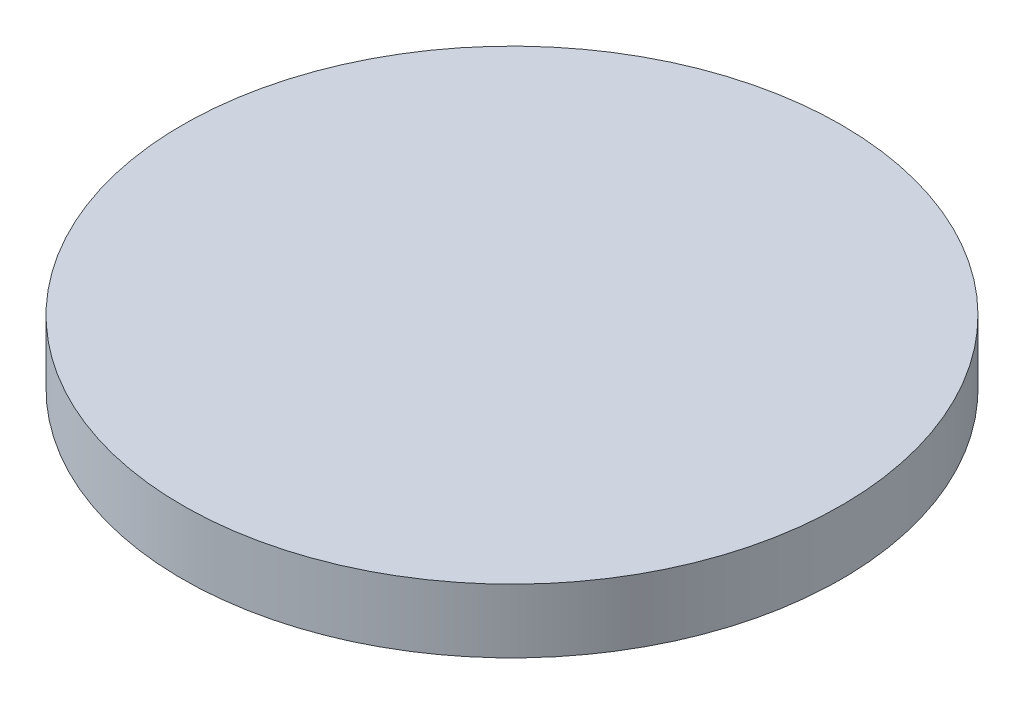
ISO-10303-21;
HEADER;
FILE_DESCRIPTION(('STEP AP214'),'2;1');
FILE_NAME('part.step','',(''),(''),'','','');
FILE_SCHEMA(('AUTOMOTIVE_DESIGN { 1 0 10303 214 1 1 1 1 }'));
ENDSEC;
DATA;
#1=APPLICATION_CONTEXT('core data for automotive mechanical design processes');
#2=APPLICATION_PROTOCOL_DEFINITION('international standard','automotive_design',2000,#1);
#3=PRODUCT_CONTEXT('',#1,'mechanical');
#4=PRODUCT('Part','Part','',(#3));
#5=PRODUCT_RELATED_PRODUCT_CATEGORY('part','',(#4));
#6=PRODUCT_DEFINITION_FORMATION('','',#4);
#7=PRODUCT_DEFINITION_CONTEXT('part definition',#1,'design');
#8=PRODUCT_DEFINITION('design','',#6,#7);
#9=PRODUCT_DEFINITION_SHAPE('','',#8);
#10=(LENGTH_UNIT() NAMED_UNIT(*) SI_UNIT(.MILLI.,.METRE.));
#11=(NAMED_UNIT(*) PLANE_ANGLE_UNIT() SI_UNIT($,.RADIAN.));
#12=(NAMED_UNIT(*) SI_UNIT($,.STERADIAN.) SOLID_ANGLE_UNIT());
#13=UNCERTAINTY_MEASURE_WITH_UNIT(LENGTH_MEASURE(1.E-05),#10,'distance_accuracy_value','');
#14=(GEOMETRIC_REPRESENTATION_CONTEXT(3) GLOBAL_UNCERTAINTY_ASSIGNED_CONTEXT((#13)) GLOBAL_UNIT_ASSIGNED_CONTEXT((#10,
#11,#12)) REPRESENTATION_CONTEXT('',''));
#15=CARTESIAN_POINT('',(0.,0.,0.));
#16=DIRECTION('',(0.,0.,1.));
#17=DIRECTION('',(1.,0.,0.));
#18=AXIS2_PLACEMENT_3D('',#15,#16,#17);
#19=CARTESIAN_POINT('',(-312.69393716758,-1885.58260369703,4006.6058874503));
#20=CARTESIAN_POINT('',(-308.655876363543,-1885.58260369703,4006.6058874503));
#21=CARTESIAN_POINT('',(-300.57975475547,-1885.58260369703,4007.00264186326));
#22=CARTESIAN_POINT('',(-288.582238542273,-1885.58260369703,4008.78230527876));
#23=CARTESIAN_POINT('',(-276.816931167634,-1885.58260369703,4011.72936135875));
#24=CARTESIAN_POINT('',(-265.39713897314,-1885.58260369703,4015.81542834216));
#25=CARTESIAN_POINT('',(-254.432840800319,-1885.58260369703,4021.00115517027));
#26=CARTESIAN_POINT('',(-244.029628834269,-1885.58260369703,4027.23660045893));
#27=CARTESIAN_POINT('',(-234.287691693199,-1885.58260369703,4034.46171346135));
#28=CARTESIAN_POINT('',(-225.30084955726,-1885.58260369703,4042.60691238968));
#29=CARTESIAN_POINT('',(-217.15565062893,-1885.58260369703,4051.59375452562));
#30=CARTESIAN_POINT('',(-209.930537626507,-1885.58260369703,4061.33569166669));
#31=CARTESIAN_POINT('',(-203.695092337853,-1885.58260369703,4071.73890363274));
#32=CARTESIAN_POINT('',(-198.509365509739,-1885.58260369703,4082.70320180556));
#33=CARTESIAN_POINT('',(-194.423298526326,-1885.58260369703,4094.12299400005));
#34=CARTESIAN_POINT('',(-191.476242446337,-1885.58260369703,4105.88830137469));
#35=CARTESIAN_POINT('',(-189.696579030845,-1885.58260369703,4117.88581758789));
#36=CARTESIAN_POINT('',(-189.101447411405,-1885.58260369703,4130.));
#37=CARTESIAN_POINT('',(-189.696579030845,-1885.58260369703,4142.11418241211));
#38=CARTESIAN_POINT('',(-191.476242446337,-1885.58260369703,4154.11169862531));
#39=CARTESIAN_POINT('',(-194.423298526326,-1885.58260369703,4165.87700599995));
#40=CARTESIAN_POINT('',(-198.509365509739,-1885.58260369703,4177.29679819444));
#41=CARTESIAN_POINT('',(-203.695092337853,-1885.58260369703,4188.26109636726));
#42=CARTESIAN_POINT('',(-209.930537626507,-1885.58260369703,4198.66430833331));
#43=CARTESIAN_POINT('',(-217.15565062893,-1885.58260369703,4208.40624547438));
#44=CARTESIAN_POINT('',(-225.30084955726,-1885.58260369703,4217.39308761032));
#45=CARTESIAN_POINT('',(-234.287691693198,-1885.58260369703,4225.53828653865));
#46=CARTESIAN_POINT('',(-244.029628834269,-1885.58260369703,4232.76339954107));
#47=CARTESIAN_POINT('',(-254.432840800319,-1885.58260369703,4238.99884482973));
#48=CARTESIAN_POINT('',(-265.39713897314,-1885.58260369703,4244.18457165784));
#49=CARTESIAN_POINT('',(-276.816931167634,-1885.58260369703,4248.27063864125));
#50=CARTESIAN_POINT('',(-288.582238542273,-1885.58260369703,4251.21769472124));
#51=CARTESIAN_POINT('',(-300.579754755469,-1885.58260369703,4252.99735813674));
#52=CARTESIAN_POINT('',(-312.69393716758,-1885.58260369703,4253.59248975617));
#53=CARTESIAN_POINT('',(-324.808119579691,-1885.58260369703,4252.99735813674));
#54=CARTESIAN_POINT('',(-336.805635792887,-1885.58260369703,4251.21769472124));
#55=CARTESIAN_POINT('',(-348.570943167527,-1885.58260369703,4248.27063864126));
#56=CARTESIAN_POINT('',(-359.990735362021,-1885.58260369703,4244.18457165784));
#57=CARTESIAN_POINT('',(-370.955033534842,-1885.58260369703,4238.99884482973));
#58=CARTESIAN_POINT('',(-381.358245500891,-1885.58260369703,4232.76339954107));
#59=CARTESIAN_POINT('',(-391.100182641962,-1885.58260369703,4225.53828653865));
#60=CARTESIAN_POINT('',(-400.087024777901,-1885.58260369703,4217.39308761032));
#61=CARTESIAN_POINT('',(-408.232223706231,-1885.58260369703,4208.40624547438));
#62=CARTESIAN_POINT('',(-415.457336708654,-1885.58260369703,4198.66430833331));
#63=CARTESIAN_POINT('',(-421.692781997308,-1885.58260369703,4188.26109636726));
#64=CARTESIAN_POINT('',(-426.878508825421,-1885.58260369703,4177.29679819444));
#65=CARTESIAN_POINT('',(-430.964575808835,-1885.58260369703,4165.87700599995));
#66=CARTESIAN_POINT('',(-433.911631888824,-1885.58260369703,4154.11169862531));
#67=CARTESIAN_POINT('',(-435.691295304316,-1885.58260369703,4142.11418241211));
#68=CARTESIAN_POINT('',(-436.286426923756,-1885.58260369703,4130.));
#69=CARTESIAN_POINT('',(-435.691295304316,-1885.58260369703,4117.88581758789));
#70=CARTESIAN_POINT('',(-433.911631888824,-1885.58260369703,4105.88830137469));
#71=CARTESIAN_POINT('',(-430.964575808835,-1885.58260369703,4094.12299400005));
#72=CARTESIAN_POINT('',(-426.878508825421,-1885.58260369703,4082.70320180556));
#73=CARTESIAN_POINT('',(-421.692781997308,-1885.58260369703,4071.73890363274));
#74=CARTESIAN_POINT('',(-415.457336708654,-1885.58260369703,4061.33569166669));
#75=CARTESIAN_POINT('',(-408.232223706231,-1885.58260369703,4051.59375452562));
#76=CARTESIAN_POINT('',(-400.087024777901,-1885.58260369703,4042.60691238968));
#77=CARTESIAN_POINT('',(-391.100182641962,-1885.58260369703,4034.46171346135));
#78=CARTESIAN_POINT('',(-381.358245500892,-1885.58260369703,4027.23660045893));
#79=CARTESIAN_POINT('',(-370.955033534842,-1885.58260369703,4021.00115517027));
#80=CARTESIAN_POINT('',(-359.990735362021,-1885.58260369703,4015.81542834216));
#81=CARTESIAN_POINT('',(-348.570943167527,-1885.58260369703,4011.72936135875));
#82=CARTESIAN_POINT('',(-336.805635792888,-1885.58260369703,4008.78230527876));
#83=CARTESIAN_POINT('',(-324.808119579691,-1885.58260369703,4007.00264186326));
#84=CARTESIAN_POINT('',(-316.731997971617,-1885.58260369703,4006.6058874503));
#85=CARTESIAN_POINT('',(-312.69393716758,-1885.58260369703,4006.6058874503));
#86=B_SPLINE_CURVE_WITH_KNOTS('',3,(#19,#20,#21,#22,#23,#24,#25,#26,#27,#28,#29,#30,#31,#32,#33,
#34,#35,#36,#37,#38,#39,#40,#41,#42,#43,#44,#45,#46,#47,#48,#49,#50,#51,#52,#53,#54,#55,#56,#57,
#58,#59,#60,#61,#62,#63,#64,#65,#66,#67,#68,#69,#70,#71,#72,#73,#74,#75,#76,#77,#78,#79,#80,#81,
#82,#83,#84,#85),.UNSPECIFIED.,.T.,.F.,(4,1,1,1,1,1,1,1,1,1,1,1,1,1,1,1,1,1,1,1,1,1,1,1,1,1,1,1,
1,1,1,1,1,1,1,1,1,1,1,1,1,1,1,1,1,1,1,1,1,1,1,1,1,1,1,1,1,1,1,1,1,1,1,1,4),(0.,0.015625,0.03125,
0.0468749999999999,0.0625,0.0781250000000002,0.09375,0.109375,0.125,0.140625,0.15625,0.171875,
0.1875,0.203125,0.21875,0.234375,0.25,0.265625,0.28125,0.296875000000001,0.3125,0.328125,
0.34375,0.359375,0.375,0.390625000000001,0.40625,0.421875,0.4375,0.453125,0.46875,0.484375,0.5,
0.515625,0.53125,0.546875,0.5625,0.578125000000001,0.59375,0.609375,0.625,0.640625000000001,
0.65625,0.671875,0.6875,0.703125,0.71875,0.734375,0.75,0.765625,0.78125,0.796875000000001,
0.8125,0.828125,0.84375,0.859375,0.875,0.890625000000001,0.90625,0.921875,0.9375,0.953125,
0.96875,0.984375,1.),.UNSPECIFIED.);
#87=DIRECTION('',(0.,-1.,0.));
#88=VECTOR('',#87,1.);
#89=SURFACE_OF_LINEAR_EXTRUSION('',#86,#88);
#90=CARTESIAN_POINT('',(-312.69393716758,-1885.58260369703,4006.6058874503));
#91=CARTESIAN_POINT('',(-308.655876363543,-1885.58260369703,4006.6058874503));
#92=CARTESIAN_POINT('',(-300.57975475547,-1885.58260369703,4007.00264186326));
#93=CARTESIAN_POINT('',(-288.582238542273,-1885.58260369703,4008.78230527876));
#94=CARTESIAN_POINT('',(-276.816931167634,-1885.58260369703,4011.72936135875));
#95=CARTESIAN_POINT('',(-265.39713897314,-1885.58260369703,4015.81542834216));
#96=CARTESIAN_POINT('',(-254.432840800319,-1885.58260369703,4021.00115517027));
#97=CARTESIAN_POINT('',(-244.029628834269,-1885.58260369703,4027.23660045893));
#98=CARTESIAN_POINT('',(-234.287691693199,-1885.58260369703,4034.46171346135));
#99=CARTESIAN_POINT('',(-225.30084955726,-1885.58260369703,4042.60691238968));
#100=CARTESIAN_POINT('',(-217.15565062893,-1885.58260369703,4051.59375452562));
#101=CARTESIAN_POINT('',(-209.930537626507,-1885.58260369703,4061.33569166669));
#102=CARTESIAN_POINT('',(-203.695092337853,-1885.58260369703,4071.73890363274));
#103=CARTESIAN_POINT('',(-198.509365509739,-1885.58260369703,4082.70320180556));
#104=CARTESIAN_POINT('',(-194.423298526326,-1885.58260369703,4094.12299400005));
#105=CARTESIAN_POINT('',(-191.476242446337,-1885.58260369703,4105.88830137469));
#106=CARTESIAN_POINT('',(-189.696579030845,-1885.58260369703,4117.88581758789));
#107=CARTESIAN_POINT('',(-189.101447411405,-1885.58260369703,4130.));
#108=CARTESIAN_POINT('',(-189.696579030845,-1885.58260369703,4142.11418241211));
#109=CARTESIAN_POINT('',(-191.476242446337,-1885.58260369703,4154.11169862531));
#110=CARTESIAN_POINT('',(-194.423298526326,-1885.58260369703,4165.87700599995));
#111=CARTESIAN_POINT('',(-198.509365509739,-1885.58260369703,4177.29679819444));
#112=CARTESIAN_POINT('',(-203.695092337853,-1885.58260369703,4188.26109636726));
#113=CARTESIAN_POINT('',(-209.930537626507,-1885.58260369703,4198.66430833331));
#114=CARTESIAN_POINT('',(-217.15565062893,-1885.58260369703,4208.40624547438));
#115=CARTESIAN_POINT('',(-225.30084955726,-1885.58260369703,4217.39308761032));
#116=CARTESIAN_POINT('',(-234.287691693198,-1885.58260369703,4225.53828653865));
#117=CARTESIAN_POINT('',(-244.029628834269,-1885.58260369703,4232.76339954107));
#118=CARTESIAN_POINT('',(-254.432840800319,-1885.58260369703,4238.99884482973));
#119=CARTESIAN_POINT('',(-265.39713897314,-1885.58260369703,4244.18457165784));
#120=CARTESIAN_POINT('',(-276.816931167634,-1885.58260369703,4248.27063864125));
#121=CARTESIAN_POINT('',(-288.582238542273,-1885.58260369703,4251.21769472124));
#122=CARTESIAN_POINT('',(-300.579754755469,-1885.58260369703,4252.99735813674));
#123=CARTESIAN_POINT('',(-312.69393716758,-1885.58260369703,4253.59248975617));
#124=CARTESIAN_POINT('',(-324.808119579691,-1885.58260369703,4252.99735813674));
#125=CARTESIAN_POINT('',(-336.805635792887,-1885.58260369703,4251.21769472124));
#126=CARTESIAN_POINT('',(-348.570943167527,-1885.58260369703,4248.27063864126));
#127=CARTESIAN_POINT('',(-359.990735362021,-1885.58260369703,4244.18457165784));
#128=CARTESIAN_POINT('',(-370.955033534842,-1885.58260369703,4238.99884482973));
#129=CARTESIAN_POINT('',(-381.358245500891,-1885.58260369703,4232.76339954107));
#130=CARTESIAN_POINT('',(-391.100182641962,-1885.58260369703,4225.53828653865));
#131=CARTESIAN_POINT('',(-400.087024777901,-1885.58260369703,4217.39308761032));
#132=CARTESIAN_POINT('',(-408.232223706231,-1885.58260369703,4208.40624547438));
#133=CARTESIAN_POINT('',(-415.457336708654,-1885.58260369703,4198.66430833331));
#134=CARTESIAN_POINT('',(-421.692781997308,-1885.58260369703,4188.26109636726));
#135=CARTESIAN_POINT('',(-426.878508825421,-1885.58260369703,4177.29679819444));
#136=CARTESIAN_POINT('',(-430.964575808835,-1885.58260369703,4165.87700599995));
#137=CARTESIAN_POINT('',(-433.911631888824,-1885.58260369703,4154.11169862531));
#138=CARTESIAN_POINT('',(-435.691295304316,-1885.58260369703,4142.11418241211));
#139=CARTESIAN_POINT('',(-436.286426923756,-1885.58260369703,4130.));
#140=CARTESIAN_POINT('',(-435.691295304316,-1885.58260369703,4117.88581758789));
#141=CARTESIAN_POINT('',(-433.911631888824,-1885.58260369703,4105.88830137469));
#142=CARTESIAN_POINT('',(-430.964575808835,-1885.58260369703,4094.12299400005));
#143=CARTESIAN_POINT('',(-426.878508825421,-1885.58260369703,4082.70320180556));
#144=CARTESIAN_POINT('',(-421.692781997308,-1885.58260369703,4071.73890363274));
#145=CARTESIAN_POINT('',(-415.457336708654,-1885.58260369703,4061.33569166669));
#146=CARTESIAN_POINT('',(-408.232223706231,-1885.58260369703,4051.59375452562));
#147=CARTESIAN_POINT('',(-400.087024777901,-1885.58260369703,4042.60691238968));
#148=CARTESIAN_POINT('',(-391.100182641962,-1885.58260369703,4034.46171346135));
#149=CARTESIAN_POINT('',(-381.358245500892,-1885.58260369703,4027.23660045893));
#150=CARTESIAN_POINT('',(-370.955033534842,-1885.58260369703,4021.00115517027));
#151=CARTESIAN_POINT('',(-359.990735362021,-1885.58260369703,4015.81542834216));
#152=CARTESIAN_POINT('',(-348.570943167527,-1885.58260369703,4011.72936135875));
#153=CARTESIAN_POINT('',(-336.805635792888,-1885.58260369703,4008.78230527876));
#154=CARTESIAN_POINT('',(-324.808119579691,-1885.58260369703,4007.00264186326));
#155=CARTESIAN_POINT('',(-316.731997971617,-1885.58260369703,4006.6058874503));
#156=CARTESIAN_POINT('',(-312.69393716758,-1885.58260369703,4006.6058874503));
#157=B_SPLINE_CURVE_WITH_KNOTS('',3,(#90,#91,#92,#93,#94,#95,#96,#97,#98,#99,#100,#101,#102,
#103,#104,#105,#106,#107,#108,#109,#110,#111,#112,#113,#114,#115,#116,#117,#118,#119,#120,#121,
#122,#123,#124,#125,#126,#127,#128,#129,#130,#131,#132,#133,#134,#135,#136,#137,#138,#139,#140,
#141,#142,#143,#144,#145,#146,#147,#148,#149,#150,#151,#152,#153,#154,#155,#156),.UNSPECIFIED.,
.T.,.F.,(4,1,1,1,1,1,1,1,1,1,1,1,1,1,1,1,1,1,1,1,1,1,1,1,1,1,1,1,1,1,1,1,1,1,1,1,1,1,1,1,1,1,1,
1,1,1,1,1,1,1,1,1,1,1,1,1,1,1,1,1,1,1,1,1,4),(0.,0.015625,0.03125,0.0468749999999999,0.0625,
0.0781250000000002,0.09375,0.109375,0.125,0.140625,0.15625,0.171875,0.1875,0.203125,0.21875,
0.234375,0.25,0.265625,0.28125,0.296875000000001,0.3125,0.328125,0.34375,0.359375,0.375,
0.390625000000001,0.40625,0.421875,0.4375,0.453125,0.46875,0.484375,0.5,0.515625,0.53125,
0.546875,0.5625,0.578125000000001,0.59375,0.609375,0.625,0.640625000000001,0.65625,0.671875,
0.6875,0.703125,0.71875,0.734375,0.75,0.765625,0.78125,0.796875000000001,0.8125,0.828125,
0.84375,0.859375,0.875,0.890625000000001,0.90625,0.921875,0.9375,0.953125,0.96875,0.984375,1.),.UNSPECIFIED.);
#158=CARTESIAN_POINT('',(-312.69393716758,-1885.58260369703,4006.6058874503));
#159=VERTEX_POINT('',#158);
#160=EDGE_CURVE('E9',#159,#159,#157,.T.);
#161=ORIENTED_EDGE('',*,*,#160,.T.);
#162=EDGE_LOOP('',(#161));
#163=FACE_BOUND('',#162,.T.);
#164=CARTESIAN_POINT('',(-312.69393716758,-1909.49645951327,4006.6058874503));
#165=CARTESIAN_POINT('',(-314.712967569599,-1909.49645951327,4006.6058874503));
#166=CARTESIAN_POINT('',(-316.731997971617,-1909.49645951327,4006.65548175192));
#167=CARTESIAN_POINT('',(-320.765197684033,-1909.49645951327,4006.85362014829));
#168=CARTESIAN_POINT('',(-322.77936699443,-1909.49645951327,4007.00216424303));
#169=CARTESIAN_POINT('',(-326.797983431981,-1909.49645951327,4007.39796341552));
#170=CARTESIAN_POINT('',(-328.802430559135,-1909.49645951327,4007.64521849326));
#171=CARTESIAN_POINT('',(-332.796788353549,-1909.49645951327,4008.23772550128));
#172=CARTESIAN_POINT('',(-334.786699020809,-1909.49645951327,4008.58297743155));
#173=CARTESIAN_POINT('',(-338.747169618781,-1909.49645951327,4009.37076401413));
#174=CARTESIAN_POINT('',(-340.717729549494,-1909.49645951327,4009.81329866644));
#175=CARTESIAN_POINT('',(-344.634777576808,-1909.49645951327,4010.79446811973));
#176=CARTESIAN_POINT('',(-346.581265673409,-1909.49645951327,4011.3331029207));
#177=CARTESIAN_POINT('',(-350.445448934931,-1909.49645951327,4012.50529009793));
#178=CARTESIAN_POINT('',(-352.363144099853,-1909.49645951327,4013.13884247419));
#179=CARTESIAN_POINT('',(-356.165159046287,-1909.49645951327,4014.49922517455));
#180=CARTESIAN_POINT('',(-358.049478827799,-1909.49645951327,4015.22605549865));
#181=CARTESIAN_POINT('',(-361.780160555685,-1909.49645951327,4016.77135446724));
#182=CARTESIAN_POINT('',(-363.626522502058,-1909.49645951327,4017.58982311173));
#183=CARTESIAN_POINT('',(-367.276888885286,-1909.49645951327,4019.31631783009));
#184=CARTESIAN_POINT('',(-369.080893322141,-1909.49645951327,4020.22434390397));
#185=CARTESIAN_POINT('',(-372.642145011953,-1909.49645951327,4022.12787259009));
#186=CARTESIAN_POINT('',(-374.39939226491,-1909.49645951327,4023.12337520235));
#187=CARTESIAN_POINT('',(-377.862955061168,-1909.49645951327,4025.19935485078));
#188=CARTESIAN_POINT('',(-379.569270604469,-1909.49645951327,4026.27983188697));
#189=CARTESIAN_POINT('',(-382.926795455656,-1909.49645951327,4028.52325826881));
#190=CARTESIAN_POINT('',(-384.578004763541,-1909.49645951327,4029.68620761448));
#191=CARTESIAN_POINT('',(-387.821407969725,-1909.49645951327,4032.09167937412));
#192=CARTESIAN_POINT('',(-389.413601868023,-1909.49645951327,4033.33420178811));
#193=CARTESIAN_POINT('',(-392.535065080858,-1909.49645951327,4035.89592044323));
#194=CARTESIAN_POINT('',(-394.064334395395,-1909.49645951327,4037.21511668437));
#195=CARTESIAN_POINT('',(-397.056342265605,-1909.49645951327,4039.92691454722));
#196=CARTESIAN_POINT('',(-398.519080821277,-1909.49645951327,4041.31951616893));
#197=CARTESIAN_POINT('',(-401.374420998655,-1909.49645951327,4044.1748563463));
#198=CARTESIAN_POINT('',(-402.767022620361,-1909.49645951327,4045.63759490198));
#199=CARTESIAN_POINT('',(-405.478820483208,-1909.49645951327,4048.62960277219));
#200=CARTESIAN_POINT('',(-406.798016724351,-1909.49645951327,4050.15887208672));
#201=CARTESIAN_POINT('',(-409.359735379476,-1909.49645951327,4053.28033529956));
#202=CARTESIAN_POINT('',(-410.602257793459,-1909.49645951327,4054.87252919786));
#203=CARTESIAN_POINT('',(-413.007729553106,-1909.49645951327,4058.11593240404));
#204=CARTESIAN_POINT('',(-414.170678898769,-1909.49645951327,4059.76714171193));
#205=CARTESIAN_POINT('',(-416.414105280615,-1909.49645951327,4063.12466656311));
#206=CARTESIAN_POINT('',(-417.494582316798,-1909.49645951327,4064.83098210641));
#207=CARTESIAN_POINT('',(-419.570561965234,-1909.49645951327,4068.29454490267));
#208=CARTESIAN_POINT('',(-420.566064577487,-1909.49645951327,4070.05179215563));
#209=CARTESIAN_POINT('',(-422.469593263615,-1909.49645951327,4073.61304384544));
#210=CARTESIAN_POINT('',(-423.37761933749,-1909.49645951327,4075.41704828229));
#211=CARTESIAN_POINT('',(-425.104114055855,-1909.49645951327,4079.06741466552));
#212=CARTESIAN_POINT('',(-425.922582700344,-1909.49645951327,4080.91377661189));
#213=CARTESIAN_POINT('',(-427.467881668932,-1909.49645951327,4084.64445833978));
#214=CARTESIAN_POINT('',(-428.19471199303,-1909.49645951327,4086.52877812129));
#215=CARTESIAN_POINT('',(-429.555094693388,-1909.49645951327,4090.33079306773));
#216=CARTESIAN_POINT('',(-430.188647069647,-1909.49645951327,4092.24848823265));
#217=CARTESIAN_POINT('',(-431.360834246881,-1909.49645951327,4096.11267149417));
#218=CARTESIAN_POINT('',(-431.899469047855,-1909.49645951327,4098.05915959077));
#219=CARTESIAN_POINT('',(-432.88063850114,-1909.49645951327,4101.97620761809));
#220=CARTESIAN_POINT('',(-433.323173153451,-1909.49645951327,4103.9467675488));
#221=CARTESIAN_POINT('',(-434.110959736031,-1909.49645951327,4107.90723814677));
#222=CARTESIAN_POINT('',(-434.456211666301,-1909.49645951327,4109.89714881403));
#223=CARTESIAN_POINT('',(-435.048718674317,-1909.49645951327,4113.89150660845));
#224=CARTESIAN_POINT('',(-435.295973752063,-1909.49645951327,4115.8959537356));
#225=CARTESIAN_POINT('',(-435.691772924552,-1909.49645951327,4119.91457017315));
#226=CARTESIAN_POINT('',(-435.840317019294,-1909.49645951327,4121.92873948355));
#227=CARTESIAN_POINT('',(-436.038455415656,-1909.49645951327,4125.96193919596));
#228=CARTESIAN_POINT('',(-436.088049717276,-1909.49645951327,4127.98096959798));
#229=CARTESIAN_POINT('',(-436.088049717276,-1909.49645951327,4132.01903040202));
#230=CARTESIAN_POINT('',(-436.038455415656,-1909.49645951327,4134.03806080404));
#231=CARTESIAN_POINT('',(-435.840317019294,-1909.49645951327,4138.07126051645));
#232=CARTESIAN_POINT('',(-435.691772924552,-1909.49645951327,4140.08542982685));
#233=CARTESIAN_POINT('',(-435.295973752063,-1909.49645951327,4144.1040462644));
#234=CARTESIAN_POINT('',(-435.048718674317,-1909.49645951327,4146.10849339156));
#235=CARTESIAN_POINT('',(-434.456211666301,-1909.49645951327,4150.10285118597));
#236=CARTESIAN_POINT('',(-434.110959736031,-1909.49645951327,4152.09276185323));
#237=CARTESIAN_POINT('',(-433.323173153451,-1909.49645951327,4156.0532324512));
#238=CARTESIAN_POINT('',(-432.88063850114,-1909.49645951327,4158.02379238191));
#239=CARTESIAN_POINT('',(-431.899469047855,-1909.49645951327,4161.94084040923));
#240=CARTESIAN_POINT('',(-431.360834246881,-1909.49645951327,4163.88732850583));
#241=CARTESIAN_POINT('',(-430.188647069647,-1909.49645951327,4167.75151176735));
#242=CARTESIAN_POINT('',(-429.555094693388,-1909.49645951327,4169.66920693227));
#243=CARTESIAN_POINT('',(-428.19471199303,-1909.49645951327,4173.4712218787));
#244=CARTESIAN_POINT('',(-427.467881668932,-1909.49645951327,4175.35554166022));
#245=CARTESIAN_POINT('',(-425.922582700344,-1909.49645951327,4179.0862233881));
#246=CARTESIAN_POINT('',(-425.104114055854,-1909.49645951327,4180.93258533448));
#247=CARTESIAN_POINT('',(-423.37761933749,-1909.49645951327,4184.58295171771));
#248=CARTESIAN_POINT('',(-422.469593263615,-1909.49645951327,4186.38695615456));
#249=CARTESIAN_POINT('',(-420.566064577487,-1909.49645951327,4189.94820784437));
#250=CARTESIAN_POINT('',(-419.570561965234,-1909.49645951327,4191.70545509733));
#251=CARTESIAN_POINT('',(-417.494582316798,-1909.49645951327,4195.16901789359));
#252=CARTESIAN_POINT('',(-416.414105280615,-1909.49645951327,4196.87533343689));
#253=CARTESIAN_POINT('',(-414.170678898769,-1909.49645951327,4200.23285828808));
#254=CARTESIAN_POINT('',(-413.007729553106,-1909.49645951327,4201.88406759596));
#255=CARTESIAN_POINT('',(-410.602257793459,-1909.49645951327,4205.12747080215));
#256=CARTESIAN_POINT('',(-409.359735379476,-1909.49645951327,4206.71966470044));
#257=CARTESIAN_POINT('',(-406.79801672435,-1909.49645951327,4209.84112791328));
#258=CARTESIAN_POINT('',(-405.478820483208,-1909.49645951327,4211.37039722781));
#259=CARTESIAN_POINT('',(-402.76702262036,-1909.49645951327,4214.36240509802));
#260=CARTESIAN_POINT('',(-401.374420998655,-1909.49645951327,4215.8251436537));
#261=CARTESIAN_POINT('',(-398.519080821277,-1909.49645951327,4218.68048383107));
#262=CARTESIAN_POINT('',(-397.056342265604,-1909.49645951327,4220.07308545278));
#263=CARTESIAN_POINT('',(-394.064334395395,-1909.49645951327,4222.78488331563));
#264=CARTESIAN_POINT('',(-392.535065080858,-1909.49645951327,4224.10407955677));
#265=CARTESIAN_POINT('',(-389.413601868023,-1909.49645951327,4226.66579821189));
#266=CARTESIAN_POINT('',(-387.821407969725,-1909.49645951327,4227.90832062588));
#267=CARTESIAN_POINT('',(-384.578004763541,-1909.49645951327,4230.31379238553));
#268=CARTESIAN_POINT('',(-382.926795455655,-1909.49645951327,4231.47674173119));
#269=CARTESIAN_POINT('',(-379.569270604468,-1909.49645951327,4233.72016811304));
#270=CARTESIAN_POINT('',(-377.862955061167,-1909.49645951327,4234.80064514922));
#271=CARTESIAN_POINT('',(-374.399392264909,-1909.49645951327,4236.87662479765));
#272=CARTESIAN_POINT('',(-372.642145011952,-1909.49645951327,4237.87212740991));
#273=CARTESIAN_POINT('',(-369.080893322141,-1909.49645951327,4239.77565609604));
#274=CARTESIAN_POINT('',(-367.276888885286,-1909.49645951327,4240.68368216991));
#275=CARTESIAN_POINT('',(-363.626522502058,-1909.49645951327,4242.41017688827));
#276=CARTESIAN_POINT('',(-361.780160555685,-1909.49645951327,4243.22864553276));
#277=CARTESIAN_POINT('',(-358.049478827799,-1909.49645951327,4244.77394450135));
#278=CARTESIAN_POINT('',(-356.165159046286,-1909.49645951327,4245.50077482545));
#279=CARTESIAN_POINT('',(-352.363144099852,-1909.49645951327,4246.86115752581));
#280=CARTESIAN_POINT('',(-350.445448934931,-1909.49645951327,4247.49470990207));
#281=CARTESIAN_POINT('',(-346.581265673408,-1909.49645951327,4248.6668970793));
#282=CARTESIAN_POINT('',(-344.634777576808,-1909.49645951327,4249.20553188027));
#283=CARTESIAN_POINT('',(-340.717729549494,-1909.49645951327,4250.18670133356));
#284=CARTESIAN_POINT('',(-338.747169618781,-1909.49645951327,4250.62923598587));
#285=CARTESIAN_POINT('',(-334.786699020808,-1909.49645951327,4251.41702256845));
#286=CARTESIAN_POINT('',(-332.796788353549,-1909.49645951327,4251.76227449872));
#287=CARTESIAN_POINT('',(-328.802430559135,-1909.49645951327,4252.35478150673));
#288=CARTESIAN_POINT('',(-326.797983431981,-1909.49645951327,4252.60203658448));
#289=CARTESIAN_POINT('',(-322.77936699443,-1909.49645951327,4252.99783575697));
#290=CARTESIAN_POINT('',(-320.765197684033,-1909.49645951327,4253.14637985171));
#291=CARTESIAN_POINT('',(-316.731997971617,-1909.49645951327,4253.34451824807));
#292=CARTESIAN_POINT('',(-314.712967569599,-1909.49645951327,4253.39411254969));
#293=CARTESIAN_POINT('',(-310.674906765562,-1909.49645951327,4253.39411254969));
#294=CARTESIAN_POINT('',(-308.655876363543,-1909.49645951327,4253.34451824807));
#295=CARTESIAN_POINT('',(-304.622676651128,-1909.49645951327,4253.14637985171));
#296=CARTESIAN_POINT('',(-302.608507340731,-1909.49645951327,4252.99783575697));
#297=CARTESIAN_POINT('',(-298.589890903179,-1909.49645951327,4252.60203658448));
#298=CARTESIAN_POINT('',(-296.585443776025,-1909.49645951327,4252.35478150673));
#299=CARTESIAN_POINT('',(-292.591085981612,-1909.49645951327,4251.76227449872));
#300=CARTESIAN_POINT('',(-290.601175314352,-1909.49645951327,4251.41702256845));
#301=CARTESIAN_POINT('',(-286.64070471638,-1909.49645951327,4250.62923598587));
#302=CARTESIAN_POINT('',(-284.670144785666,-1909.49645951327,4250.18670133356));
#303=CARTESIAN_POINT('',(-280.753096758353,-1909.49645951327,4249.20553188027));
#304=CARTESIAN_POINT('',(-278.806608661752,-1909.49645951327,4248.6668970793));
#305=CARTESIAN_POINT('',(-274.94242540023,-1909.49645951327,4247.49470990207));
#306=CARTESIAN_POINT('',(-273.024730235308,-1909.49645951327,4246.86115752581));
#307=CARTESIAN_POINT('',(-269.222715288874,-1909.49645951327,4245.50077482545));
#308=CARTESIAN_POINT('',(-267.338395507361,-1909.49645951327,4244.77394450135));
#309=CARTESIAN_POINT('',(-263.607713779476,-1909.49645951327,4243.22864553276));
#310=CARTESIAN_POINT('',(-261.761351833102,-1909.49645951327,4242.41017688827));
#311=CARTESIAN_POINT('',(-258.110985449875,-1909.49645951327,4240.68368216991));
#312=CARTESIAN_POINT('',(-256.30698101302,-1909.49645951327,4239.77565609603));
#313=CARTESIAN_POINT('',(-252.745729323208,-1909.49645951327,4237.87212740991));
#314=CARTESIAN_POINT('',(-250.988482070251,-1909.49645951327,4236.87662479765));
#315=CARTESIAN_POINT('',(-247.524919273993,-1909.49645951327,4234.80064514922));
#316=CARTESIAN_POINT('',(-245.818603730692,-1909.49645951327,4233.72016811303));
#317=CARTESIAN_POINT('',(-242.461078879505,-1909.49645951327,4231.47674173119));
#318=CARTESIAN_POINT('',(-240.80986957162,-1909.49645951327,4230.31379238552));
#319=CARTESIAN_POINT('',(-237.566466365436,-1909.49645951327,4227.90832062588));
#320=CARTESIAN_POINT('',(-235.974272467138,-1909.49645951327,4226.6657982119));
#321=CARTESIAN_POINT('',(-232.852809254303,-1909.49645951327,4224.10407955677));
#322=CARTESIAN_POINT('',(-231.323539939766,-1909.49645951327,4222.78488331563));
#323=CARTESIAN_POINT('',(-228.331532069556,-1909.49645951327,4220.07308545278));
#324=CARTESIAN_POINT('',(-226.868793513884,-1909.49645951327,4218.68048383107));
#325=CARTESIAN_POINT('',(-224.013453336506,-1909.49645951327,4215.8251436537));
#326=CARTESIAN_POINT('',(-222.6208517148,-1909.49645951327,4214.36240509802));
#327=CARTESIAN_POINT('',(-219.909053851953,-1909.49645951327,4211.37039722781));
#328=CARTESIAN_POINT('',(-218.58985761081,-1909.49645951327,4209.84112791328));
#329=CARTESIAN_POINT('',(-216.028138955685,-1909.49645951327,4206.71966470044));
#330=CARTESIAN_POINT('',(-214.785616541702,-1909.49645951327,4205.12747080214));
#331=CARTESIAN_POINT('',(-212.380144782055,-1909.49645951327,4201.88406759596));
#332=CARTESIAN_POINT('',(-211.217195436392,-1909.49645951327,4200.23285828807));
#333=CARTESIAN_POINT('',(-208.973769054545,-1909.49645951327,4196.87533343689));
#334=CARTESIAN_POINT('',(-207.893292018363,-1909.49645951327,4195.16901789359));
#335=CARTESIAN_POINT('',(-205.817312369927,-1909.49645951327,4191.70545509733));
#336=CARTESIAN_POINT('',(-204.821809757674,-1909.49645951327,4189.94820784437));
#337=CARTESIAN_POINT('',(-202.918281071546,-1909.49645951327,4186.38695615456));
#338=CARTESIAN_POINT('',(-202.010254997671,-1909.49645951327,4184.5829517177));
#339=CARTESIAN_POINT('',(-200.283760279306,-1909.49645951327,4180.93258533448));
#340=CARTESIAN_POINT('',(-199.465291634817,-1909.49645951327,4179.08622338811));
#341=CARTESIAN_POINT('',(-197.919992666229,-1909.49645951327,4175.35554166022));
#342=CARTESIAN_POINT('',(-197.193162342131,-1909.49645951327,4173.47122187871));
#343=CARTESIAN_POINT('',(-195.832779641773,-1909.49645951327,4169.66920693227));
#344=CARTESIAN_POINT('',(-195.199227265514,-1909.49645951327,4167.75151176735));
#345=CARTESIAN_POINT('',(-194.02704008828,-1909.49645951327,4163.88732850583));
#346=CARTESIAN_POINT('',(-193.488405287306,-1909.49645951327,4161.94084040923));
#347=CARTESIAN_POINT('',(-192.507235834021,-1909.49645951327,4158.02379238191));
#348=CARTESIAN_POINT('',(-192.06470118171,-1909.49645951327,4156.0532324512));
#349=CARTESIAN_POINT('',(-191.276914599129,-1909.49645951327,4152.09276185323));
#350=CARTESIAN_POINT('',(-190.93166266886,-1909.49645951327,4150.10285118597));
#351=CARTESIAN_POINT('',(-190.339155660844,-1909.49645951327,4146.10849339156));
#352=CARTESIAN_POINT('',(-190.091900583098,-1909.49645951327,4144.1040462644));
#353=CARTESIAN_POINT('',(-189.696101410609,-1909.49645951327,4140.08542982685));
#354=CARTESIAN_POINT('',(-189.547557315867,-1909.49645951327,4138.07126051645));
#355=CARTESIAN_POINT('',(-189.349418919505,-1909.49645951327,4134.03806080404));
#356=CARTESIAN_POINT('',(-189.299824617885,-1909.49645951327,4132.01903040202));
#357=CARTESIAN_POINT('',(-189.299824617885,-1909.49645951327,4127.98096959798));
#358=CARTESIAN_POINT('',(-189.349418919505,-1909.49645951327,4125.96193919596));
#359=CARTESIAN_POINT('',(-189.547557315867,-1909.49645951327,4121.92873948355));
#360=CARTESIAN_POINT('',(-189.696101410609,-1909.49645951327,4119.91457017315));
#361=CARTESIAN_POINT('',(-190.091900583098,-1909.49645951327,4115.8959537356));
#362=CARTESIAN_POINT('',(-190.339155660844,-1909.49645951327,4113.89150660844));
#363=CARTESIAN_POINT('',(-190.93166266886,-1909.49645951327,4109.89714881403));
#364=CARTESIAN_POINT('',(-191.276914599129,-1909.49645951327,4107.90723814677));
#365=CARTESIAN_POINT('',(-192.06470118171,-1909.49645951327,4103.9467675488));
#366=CARTESIAN_POINT('',(-192.50723583402,-1909.49645951327,4101.97620761809));
#367=CARTESIAN_POINT('',(-193.488405287306,-1909.49645951327,4098.05915959077));
#368=CARTESIAN_POINT('',(-194.02704008828,-1909.49645951327,4096.11267149417));
#369=CARTESIAN_POINT('',(-195.199227265514,-1909.49645951327,4092.24848823265));
#370=CARTESIAN_POINT('',(-195.832779641773,-1909.49645951327,4090.33079306773));
#371=CARTESIAN_POINT('',(-197.193162342131,-1909.49645951327,4086.52877812129));
#372=CARTESIAN_POINT('',(-197.919992666229,-1909.49645951327,4084.64445833978));
#373=CARTESIAN_POINT('',(-199.465291634817,-1909.49645951327,4080.9137766119));
#374=CARTESIAN_POINT('',(-200.283760279306,-1909.49645951327,4079.06741466552));
#375=CARTESIAN_POINT('',(-202.010254997671,-1909.49645951327,4075.41704828229));
#376=CARTESIAN_POINT('',(-202.918281071546,-1909.49645951327,4073.61304384544));
#377=CARTESIAN_POINT('',(-204.821809757674,-1909.49645951327,4070.05179215563));
#378=CARTESIAN_POINT('',(-205.817312369927,-1909.49645951327,4068.29454490267));
#379=CARTESIAN_POINT('',(-207.893292018363,-1909.49645951327,4064.83098210641));
#380=CARTESIAN_POINT('',(-208.973769054546,-1909.49645951327,4063.12466656311));
#381=CARTESIAN_POINT('',(-211.217195436392,-1909.49645951327,4059.76714171193));
#382=CARTESIAN_POINT('',(-212.380144782055,-1909.49645951327,4058.11593240404));
#383=CARTESIAN_POINT('',(-214.785616541702,-1909.49645951327,4054.87252919785));
#384=CARTESIAN_POINT('',(-216.028138955685,-1909.49645951327,4053.28033529956));
#385=CARTESIAN_POINT('',(-218.589857610811,-1909.49645951327,4050.15887208672));
#386=CARTESIAN_POINT('',(-219.909053851953,-1909.49645951327,4048.62960277219));
#387=CARTESIAN_POINT('',(-222.6208517148,-1909.49645951327,4045.63759490198));
#388=CARTESIAN_POINT('',(-224.013453336506,-1909.49645951327,4044.1748563463));
#389=CARTESIAN_POINT('',(-226.868793513884,-1909.49645951327,4041.31951616893));
#390=CARTESIAN_POINT('',(-228.331532069556,-1909.49645951327,4039.92691454722));
#391=CARTESIAN_POINT('',(-231.323539939766,-1909.49645951327,4037.21511668437));
#392=CARTESIAN_POINT('',(-232.852809254303,-1909.49645951327,4035.89592044323));
#393=CARTESIAN_POINT('',(-235.974272467138,-1909.49645951327,4033.33420178811));
#394=CARTESIAN_POINT('',(-237.566466365436,-1909.49645951327,4032.09167937412));
#395=CARTESIAN_POINT('',(-240.80986957162,-1909.49645951327,4029.68620761447));
#396=CARTESIAN_POINT('',(-242.461078879506,-1909.49645951327,4028.52325826881));
#397=CARTESIAN_POINT('',(-245.818603730692,-1909.49645951327,4026.27983188697));
#398=CARTESIAN_POINT('',(-247.524919273993,-1909.49645951327,4025.19935485078));
#399=CARTESIAN_POINT('',(-250.988482070251,-1909.49645951327,4023.12337520235));
#400=CARTESIAN_POINT('',(-252.745729323209,-1909.49645951327,4022.12787259009));
#401=CARTESIAN_POINT('',(-256.30698101302,-1909.49645951327,4020.22434390397));
#402=CARTESIAN_POINT('',(-258.110985449875,-1909.49645951327,4019.31631783009));
#403=CARTESIAN_POINT('',(-261.761351833103,-1909.49645951327,4017.58982311172));
#404=CARTESIAN_POINT('',(-263.607713779476,-1909.49645951327,4016.77135446724));
#405=CARTESIAN_POINT('',(-267.338395507362,-1909.49645951327,4015.22605549865));
#406=CARTESIAN_POINT('',(-269.222715288874,-1909.49645951327,4014.49922517455));
#407=CARTESIAN_POINT('',(-273.024730235308,-1909.49645951327,4013.13884247419));
#408=CARTESIAN_POINT('',(-274.94242540023,-1909.49645951327,4012.50529009793));
#409=CARTESIAN_POINT('',(-278.806608661752,-1909.49645951327,4011.3331029207));
#410=CARTESIAN_POINT('',(-280.753096758353,-1909.49645951327,4010.79446811973));
#411=CARTESIAN_POINT('',(-284.670144785667,-1909.49645951327,4009.81329866644));
#412=CARTESIAN_POINT('',(-286.64070471638,-1909.49645951327,4009.37076401413));
#413=CARTESIAN_POINT('',(-290.601175314352,-1909.49645951327,4008.58297743155));
#414=CARTESIAN_POINT('',(-292.591085981612,-1909.49645951327,4008.23772550128));
#415=CARTESIAN_POINT('',(-296.585443776026,-1909.49645951327,4007.64521849326));
#416=CARTESIAN_POINT('',(-298.58989090318,-1909.49645951327,4007.39796341552));
#417=CARTESIAN_POINT('',(-302.608507340731,-1909.49645951327,4007.00216424303));
#418=CARTESIAN_POINT('',(-304.622676651128,-1909.49645951327,4006.85362014829));
#419=CARTESIAN_POINT('',(-308.655876363543,-1909.49645951327,4006.65548175192));
#420=CARTESIAN_POINT('',(-310.674906765562,-1909.49645951327,4006.6058874503));
#421=CARTESIAN_POINT('',(-312.69393716758,-1909.49645951327,4006.6058874503));
#422=B_SPLINE_CURVE_WITH_KNOTS('',3,(#164,#165,#166,#167,#168,#169,#170,#171,#172,#173,#174,
#175,#176,#177,#178,#179,#180,#181,#182,#183,#184,#185,#186,#187,#188,#189,#190,#191,#192,#193,
#194,#195,#196,#197,#198,#199,#200,#201,#202,#203,#204,#205,#206,#207,#208,#209,#210,#211,#212,
#213,#214,#215,#216,#217,#218,#219,#220,#221,#222,#223,#224,#225,#226,#227,#228,#229,#230,#231,
#232,#233,#234,#235,#236,#237,#238,#239,#240,#241,#242,#243,#244,#245,#246,#247,#248,#249,#250,
#251,#252,#253,#254,#255,#256,#257,#258,#259,#260,#261,#262,#263,#264,#265,#266,#267,#268,#269,
#270,#271,#272,#273,#274,#275,#276,#277,#278,#279,#280,#281,#282,#283,#284,#285,#286,#287,#288,
#289,#290,#291,#292,#293,#294,#295,#296,#297,#298,#299,#300,#301,#302,#303,#304,#305,#306,#307,
#308,#309,#310,#311,#312,#313,#314,#315,#316,#317,#318,#319,#320,#321,#322,#323,#324,#325,#326,
#327,#328,#329,#330,#331,#332,#333,#334,#335,#336,#337,#338,#339,#340,#341,#342,#343,#344,#345,
#346,#347,#348,#349,#350,#351,#352,#353,#354,#355,#356,#357,#358,#359,#360,#361,#362,#363,#364,
#365,#366,#367,#368,#369,#370,#371,#372,#373,#374,#375,#376,#377,#378,#379,#380,#381,#382,#383,
#384,#385,#386,#387,#388,#389,#390,#391,#392,#393,#394,#395,#396,#397,#398,#399,#400,#401,#402,
#403,#404,#405,#406,#407,#408,#409,#410,#411,#412,#413,#414,#415,#416,#417,#418,#419,#420,#421),
.UNSPECIFIED.,.F.,.F.,(4,2,2,2,2,2,2,2,2,2,2,2,2,2,2,2,2,2,2,2,2,2,2,2,2,2,2,2,2,2,2,2,2,2,2,2,
2,2,2,2,2,2,2,2,2,2,2,2,2,2,2,2,2,2,2,2,2,2,2,2,2,2,2,2,2,2,2,2,2,2,2,2,2,2,2,2,2,2,2,2,2,2,2,2,
2,2,2,2,2,2,2,2,2,2,2,2,2,2,2,2,2,2,2,2,2,2,2,2,2,2,2,2,2,2,2,2,2,2,2,2,2,2,2,2,2,2,2,2,4),(0.,
6.05648549464856,12.1129709892971,18.1694564839458,24.2259419785942,30.282427473243,
36.3389129678913,42.3953984625399,48.4518839571882,54.5083694518368,60.5648549464854,
66.6213404411344,72.6778259357828,78.7343114304314,84.7907969250796,90.8472824197278,
96.9037679143762,102.960253409025,109.016738903673,115.073224398322,121.129709892971,
127.186195387619,133.242680882268,139.299166376916,145.355651871563,151.412137366214,
157.468622860862,163.52510835551,169.581593850158,175.638079344807,181.694564839456,
187.751050334104,193.807535828751,199.864021323401,205.920506818049,211.976992312699,
218.033477807347,224.089963301995,230.146448796642,236.202934291291,242.25941978594,
248.315905280589,254.372390775238,260.428876269887,266.485361764535,272.541847259185,
278.598332753832,284.654818248479,290.711303743128,296.767789237777,302.824274732425,
308.880760227075,314.937245721723,320.993731216371,327.05021671102,333.106702205669,
339.163187700317,345.219673194965,351.276158689614,357.332644184262,363.389129678911,
369.445615173559,375.502100668208,381.558586162856,387.615071657505,393.671557152153,
399.728042646802,405.78452814145,411.841013636099,417.897499130747,423.953984625396,
430.010470120045,436.066955614693,442.123441109342,448.17992660399,454.236412098639,
460.292897593287,466.349383087936,472.405868582583,478.462354077232,484.518839571881,
490.575325066529,496.631810561179,502.688296055828,508.744781550476,514.801267045124,
520.857752539773,526.914238034421,532.970723529068,539.027209023717,545.083694518366,
551.140180013015,557.196665507663,563.253151002311,569.30963649696,575.366121991608,
581.422607486256,587.479092980905,593.535578475554,599.592063970203,605.648549464851,
611.705034959499,617.761520454146,623.818005948795,629.874491443445,635.930976938093,
641.987462432741,648.04394792739,654.100433422038,660.156918916688,666.213404411336,
672.269889905984,678.326375400633,684.382860895281,690.43934638993,696.495831884578,
702.552317379227,708.608802873875,714.665288368524,720.721773863173,726.778259357821,
732.834744852469,738.891230347118,744.947715841766,751.004201336415,757.060686831064,
763.117172325712,769.173657820361,775.230143315009),.UNSPECIFIED.);
#423=CARTESIAN_POINT('',(-312.69393716758,-1909.49645951327,4006.6058874503));
#424=VERTEX_POINT('',#423);
#425=EDGE_CURVE('E24',#424,#424,#422,.F.);
#426=ORIENTED_EDGE('',*,*,#425,.F.);
#427=EDGE_LOOP('',(#426));
#428=FACE_BOUND('',#427,.T.);
#429=ADVANCED_FACE('F14',(#163,#428),#89,.T.);
#430=CARTESIAN_POINT('',(-312.69393716758,-1885.58260369703,4250.));
#431=DIRECTION('',(0.,-1.,0.));
#432=DIRECTION('',(1.,0.,0.));
#433=AXIS2_PLACEMENT_3D('',#430,#431,#432);
#434=PLANE('',#433);
#435=ORIENTED_EDGE('',*,*,#160,.F.);
#436=EDGE_LOOP('',(#435));
#437=FACE_BOUND('',#436,.T.);
#438=ADVANCED_FACE('F62',(#437),#434,.F.);
#439=CARTESIAN_POINT('',(-312.69393716758,-1909.49645951327,4250.));
#440=DIRECTION('',(0.,-1.,0.));
#441=DIRECTION('',(1.,0.,0.));
#442=AXIS2_PLACEMENT_3D('',#439,#440,#441);
#443=PLANE('',#442);
#444=ORIENTED_EDGE('',*,*,#425,.T.);
#445=EDGE_LOOP('',(#444));
#446=FACE_BOUND('',#445,.T.);
#447=ADVANCED_FACE('F31',(#446),#443,.T.);
#448=CLOSED_SHELL('',(#429,#438,#447));
#449=MANIFOLD_SOLID_BREP('B1',#448);
#450=ADVANCED_BREP_SHAPE_REPRESENTATION('',(#18,#449),#14);
#451=SHAPE_DEFINITION_REPRESENTATION(#9,#450);
ENDSEC;
END-ISO-10303-21;
